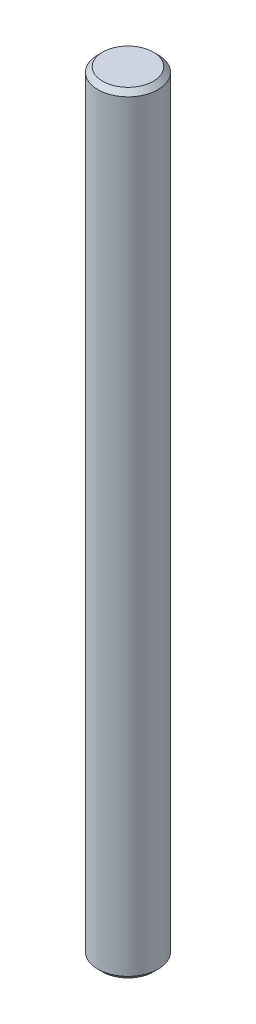
ISO-10303-21;
HEADER;
FILE_DESCRIPTION(('STEP AP214'),'2;1');
FILE_NAME('part.step','',(''),(''),'','','');
FILE_SCHEMA(('AUTOMOTIVE_DESIGN { 1 0 10303 214 1 1 1 1 }'));
ENDSEC;
DATA;
#1=APPLICATION_CONTEXT('core data for automotive mechanical design processes');
#2=APPLICATION_PROTOCOL_DEFINITION('international standard','automotive_design',2000,#1);
#3=PRODUCT_CONTEXT('',#1,'mechanical');
#4=PRODUCT('Part','Part','',(#3));
#5=PRODUCT_RELATED_PRODUCT_CATEGORY('part','',(#4));
#6=PRODUCT_DEFINITION_FORMATION('','',#4);
#7=PRODUCT_DEFINITION_CONTEXT('part definition',#1,'design');
#8=PRODUCT_DEFINITION('design','',#6,#7);
#9=PRODUCT_DEFINITION_SHAPE('','',#8);
#10=(LENGTH_UNIT() NAMED_UNIT(*) SI_UNIT(.MILLI.,.METRE.));
#11=(NAMED_UNIT(*) PLANE_ANGLE_UNIT() SI_UNIT($,.RADIAN.));
#12=(NAMED_UNIT(*) SI_UNIT($,.STERADIAN.) SOLID_ANGLE_UNIT());
#13=UNCERTAINTY_MEASURE_WITH_UNIT(LENGTH_MEASURE(1.E-05),#10,'distance_accuracy_value','');
#14=(GEOMETRIC_REPRESENTATION_CONTEXT(3) GLOBAL_UNCERTAINTY_ASSIGNED_CONTEXT((#13)) GLOBAL_UNIT_ASSIGNED_CONTEXT((#10,
#11,#12)) REPRESENTATION_CONTEXT('',''));
#15=CARTESIAN_POINT('',(0.,0.,0.));
#16=DIRECTION('',(0.,0.,1.));
#17=DIRECTION('',(1.,0.,0.));
#18=AXIS2_PLACEMENT_3D('',#15,#16,#17);
#19=CARTESIAN_POINT('',(0.,10.16,0.));
#20=DIRECTION('',(0.,-1.,0.));
#21=DIRECTION('',(0.,0.,-1.));
#22=AXIS2_PLACEMENT_3D('',#19,#20,#21);
#23=CYLINDRICAL_SURFACE('',#22,0.793749999999999);
#24=CARTESIAN_POINT('',(0.,-10.033,0.));
#25=DIRECTION('',(0.,1.,0.));
#26=DIRECTION('',(0.,0.,1.));
#27=AXIS2_PLACEMENT_3D('',#24,#25,#26);
#28=CIRCLE('',#27,0.793749999999999);
#29=CARTESIAN_POINT('',(0.,-10.033,0.793749999999999));
#30=VERTEX_POINT('',#29);
#31=EDGE_CURVE('E380',#30,#30,#28,.T.);
#32=ORIENTED_EDGE('',*,*,#31,.T.);
#33=EDGE_LOOP('',(#32));
#34=FACE_BOUND('',#33,.T.);
#35=CARTESIAN_POINT('',(0.,10.033,0.));
#36=DIRECTION('',(0.,1.,0.));
#37=DIRECTION('',(0.,0.,1.));
#38=AXIS2_PLACEMENT_3D('',#35,#36,#37);
#39=CIRCLE('',#38,0.793749999999999);
#40=CARTESIAN_POINT('',(0.,10.033,0.793749999999999));
#41=VERTEX_POINT('',#40);
#42=EDGE_CURVE('E384',#41,#41,#39,.F.);
#43=ORIENTED_EDGE('',*,*,#42,.T.);
#44=EDGE_LOOP('',(#43));
#45=FACE_BOUND('',#44,.T.);
#46=ADVANCED_FACE('F370',(#34,#45),#23,.T.);
#47=CARTESIAN_POINT('',(0.,10.16,0.));
#48=DIRECTION('',(0.,1.,0.));
#49=DIRECTION('',(0.,0.,1.));
#50=AXIS2_PLACEMENT_3D('',#47,#48,#49);
#51=PLANE('',#50);
#52=CARTESIAN_POINT('',(0.,10.16,0.));
#53=DIRECTION('',(0.,1.,0.));
#54=DIRECTION('',(0.,0.,1.));
#55=AXIS2_PLACEMENT_3D('',#52,#53,#54);
#56=CIRCLE('',#55,0.666749999999999);
#57=CARTESIAN_POINT('',(0.,10.16,0.666749999999999));
#58=VERTEX_POINT('',#57);
#59=EDGE_CURVE('E10',#58,#58,#56,.T.);
#60=ORIENTED_EDGE('',*,*,#59,.T.);
#61=EDGE_LOOP('',(#60));
#62=FACE_BOUND('',#61,.T.);
#63=ADVANCED_FACE('F403',(#62),#51,.T.);
#64=CARTESIAN_POINT('',(0.,-10.16,0.));
#65=DIRECTION('',(0.,1.,0.));
#66=DIRECTION('',(0.,0.,1.));
#67=AXIS2_PLACEMENT_3D('',#64,#65,#66);
#68=PLANE('',#67);
#69=CARTESIAN_POINT('',(0.,-10.16,0.));
#70=DIRECTION('',(0.,1.,0.));
#71=DIRECTION('',(0.,0.,1.));
#72=AXIS2_PLACEMENT_3D('',#69,#70,#71);
#73=CIRCLE('',#72,0.666749999999999);
#74=CARTESIAN_POINT('',(0.,-10.16,0.666749999999999));
#75=VERTEX_POINT('',#74);
#76=EDGE_CURVE('E376',#75,#75,#73,.F.);
#77=ORIENTED_EDGE('',*,*,#76,.T.);
#78=EDGE_LOOP('',(#77));
#79=FACE_BOUND('',#78,.T.);
#80=ADVANCED_FACE('F399',(#79),#68,.F.);
#81=CARTESIAN_POINT('',(0.,-10.033,0.));
#82=DIRECTION('',(0.,1.,0.));
#83=DIRECTION('',(0.,0.,1.));
#84=AXIS2_PLACEMENT_3D('',#81,#82,#83);
#85=CONICAL_SURFACE('',#84,0.793749999999999,0.785398163397453);
#86=ORIENTED_EDGE('',*,*,#76,.F.);
#87=EDGE_LOOP('',(#86));
#88=FACE_BOUND('',#87,.T.);
#89=ORIENTED_EDGE('',*,*,#31,.F.);
#90=EDGE_LOOP('',(#89));
#91=FACE_BOUND('',#90,.T.);
#92=ADVANCED_FACE('F394',(#88,#91),#85,.T.);
#93=CARTESIAN_POINT('',(0.,10.16,0.));
#94=DIRECTION('',(0.,-1.,0.));
#95=DIRECTION('',(0.,0.,-1.));
#96=AXIS2_PLACEMENT_3D('',#93,#94,#95);
#97=CONICAL_SURFACE('',#96,0.666749999999999,0.785398163397448);
#98=ORIENTED_EDGE('',*,*,#42,.F.);
#99=EDGE_LOOP('',(#98));
#100=FACE_BOUND('',#99,.T.);
#101=ORIENTED_EDGE('',*,*,#59,.F.);
#102=EDGE_LOOP('',(#101));
#103=FACE_BOUND('',#102,.T.);
#104=ADVANCED_FACE('F391',(#100,#103),#97,.T.);
#105=CLOSED_SHELL('',(#46,#63,#80,#92,#104));
#106=MANIFOLD_SOLID_BREP('B2',#105);
#107=ADVANCED_BREP_SHAPE_REPRESENTATION('',(#18,#106),#14);
#108=SHAPE_DEFINITION_REPRESENTATION(#9,#107);
ENDSEC;
END-ISO-10303-21;
